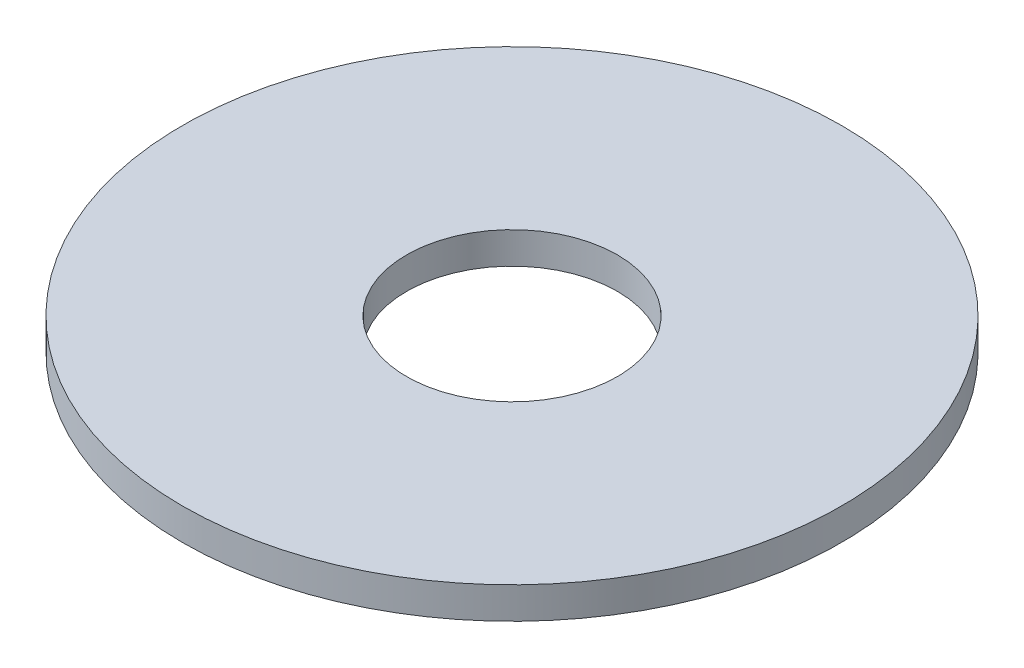
ISO-10303-21;
HEADER;
FILE_DESCRIPTION(('STEP AP214'),'2;1');
FILE_NAME('part.step','',(''),(''),'','','');
FILE_SCHEMA(('AUTOMOTIVE_DESIGN { 1 0 10303 214 1 1 1 1 }'));
ENDSEC;
DATA;
#1=APPLICATION_CONTEXT('core data for automotive mechanical design processes');
#2=APPLICATION_PROTOCOL_DEFINITION('international standard','automotive_design',2000,#1);
#3=PRODUCT_CONTEXT('',#1,'mechanical');
#4=PRODUCT('Part','Part','',(#3));
#5=PRODUCT_RELATED_PRODUCT_CATEGORY('part','',(#4));
#6=PRODUCT_DEFINITION_FORMATION('','',#4);
#7=PRODUCT_DEFINITION_CONTEXT('part definition',#1,'design');
#8=PRODUCT_DEFINITION('design','',#6,#7);
#9=PRODUCT_DEFINITION_SHAPE('','',#8);
#10=(LENGTH_UNIT() NAMED_UNIT(*) SI_UNIT(.MILLI.,.METRE.));
#11=(NAMED_UNIT(*) PLANE_ANGLE_UNIT() SI_UNIT($,.RADIAN.));
#12=(NAMED_UNIT(*) SI_UNIT($,.STERADIAN.) SOLID_ANGLE_UNIT());
#13=UNCERTAINTY_MEASURE_WITH_UNIT(LENGTH_MEASURE(1.E-05),#10,'distance_accuracy_value','');
#14=(GEOMETRIC_REPRESENTATION_CONTEXT(3) GLOBAL_UNCERTAINTY_ASSIGNED_CONTEXT((#13)) GLOBAL_UNIT_ASSIGNED_CONTEXT((#10,
#11,#12)) REPRESENTATION_CONTEXT('',''));
#15=CARTESIAN_POINT('',(0.,0.,0.));
#16=DIRECTION('',(0.,0.,1.));
#17=DIRECTION('',(1.,0.,0.));
#18=AXIS2_PLACEMENT_3D('',#15,#16,#17);
#19=CARTESIAN_POINT('',(0.,0.,0.));
#20=DIRECTION('',(0.,-1.,0.));
#21=DIRECTION('',(0.,0.,-1.));
#22=AXIS2_PLACEMENT_3D('',#19,#20,#21);
#23=CYLINDRICAL_SURFACE('',#22,12.5);
#24=CARTESIAN_POINT('',(0.,0.,0.));
#25=DIRECTION('',(0.,-1.,0.));
#26=DIRECTION('',(0.,0.,-1.));
#27=AXIS2_PLACEMENT_3D('',#24,#25,#26);
#28=CIRCLE('',#27,12.5);
#29=CARTESIAN_POINT('',(0.,0.,-12.5));
#30=VERTEX_POINT('',#29);
#31=EDGE_CURVE('E27',#30,#30,#28,.T.);
#32=ORIENTED_EDGE('',*,*,#31,.F.);
#33=EDGE_LOOP('',(#32));
#34=FACE_BOUND('',#33,.T.);
#35=CARTESIAN_POINT('',(0.,1.2,0.));
#36=DIRECTION('',(0.,-1.,0.));
#37=DIRECTION('',(0.,0.,-1.));
#38=AXIS2_PLACEMENT_3D('',#35,#36,#37);
#39=CIRCLE('',#38,12.5);
#40=CARTESIAN_POINT('',(0.,1.2,-12.5));
#41=VERTEX_POINT('',#40);
#42=EDGE_CURVE('E18',#41,#41,#39,.F.);
#43=ORIENTED_EDGE('',*,*,#42,.F.);
#44=EDGE_LOOP('',(#43));
#45=FACE_BOUND('',#44,.T.);
#46=ADVANCED_FACE('F15',(#34,#45),#23,.T.);
#47=CARTESIAN_POINT('',(0.,1.2,0.));
#48=DIRECTION('',(0.,1.,0.));
#49=DIRECTION('',(0.,0.,1.));
#50=AXIS2_PLACEMENT_3D('',#47,#48,#49);
#51=PLANE('',#50);
#52=CARTESIAN_POINT('',(0.,1.2,0.));
#53=DIRECTION('',(0.,-1.,0.));
#54=DIRECTION('',(0.,0.,-1.));
#55=AXIS2_PLACEMENT_3D('',#52,#53,#54);
#56=CIRCLE('',#55,4.);
#57=CARTESIAN_POINT('',(0.,1.2,-4.));
#58=VERTEX_POINT('',#57);
#59=EDGE_CURVE('E22',#58,#58,#56,.F.);
#60=ORIENTED_EDGE('',*,*,#59,.F.);
#61=EDGE_LOOP('',(#60));
#62=FACE_BOUND('',#61,.T.);
#63=ORIENTED_EDGE('',*,*,#42,.T.);
#64=EDGE_LOOP('',(#63));
#65=FACE_BOUND('',#64,.T.);
#66=ADVANCED_FACE('F35',(#62,#65),#51,.T.);
#67=CARTESIAN_POINT('',(0.,0.,0.));
#68=DIRECTION('',(0.,1.,0.));
#69=DIRECTION('',(0.,0.,1.));
#70=AXIS2_PLACEMENT_3D('',#67,#68,#69);
#71=PLANE('',#70);
#72=CARTESIAN_POINT('',(0.,0.,0.));
#73=DIRECTION('',(0.,-1.,0.));
#74=DIRECTION('',(0.,0.,-1.));
#75=AXIS2_PLACEMENT_3D('',#72,#73,#74);
#76=CIRCLE('',#75,4.);
#77=CARTESIAN_POINT('',(0.,0.,-4.));
#78=VERTEX_POINT('',#77);
#79=EDGE_CURVE('E10',#78,#78,#76,.T.);
#80=ORIENTED_EDGE('',*,*,#79,.F.);
#81=EDGE_LOOP('',(#80));
#82=FACE_BOUND('',#81,.T.);
#83=ORIENTED_EDGE('',*,*,#31,.T.);
#84=EDGE_LOOP('',(#83));
#85=FACE_BOUND('',#84,.T.);
#86=ADVANCED_FACE('F43',(#82,#85),#71,.F.);
#87=CARTESIAN_POINT('',(0.,1.2,0.));
#88=DIRECTION('',(0.,-1.,0.));
#89=DIRECTION('',(0.,0.,-1.));
#90=AXIS2_PLACEMENT_3D('',#87,#88,#89);
#91=CYLINDRICAL_SURFACE('',#90,4.);
#92=ORIENTED_EDGE('',*,*,#59,.T.);
#93=EDGE_LOOP('',(#92));
#94=FACE_BOUND('',#93,.T.);
#95=ORIENTED_EDGE('',*,*,#79,.T.);
#96=EDGE_LOOP('',(#95));
#97=FACE_BOUND('',#96,.T.);
#98=ADVANCED_FACE('F45',(#94,#97),#91,.F.);
#99=CLOSED_SHELL('',(#46,#66,#86,#98));
#100=MANIFOLD_SOLID_BREP('B1',#99);
#101=ADVANCED_BREP_SHAPE_REPRESENTATION('',(#18,#100),#14);
#102=SHAPE_DEFINITION_REPRESENTATION(#9,#101);
ENDSEC;
END-ISO-10303-21;
